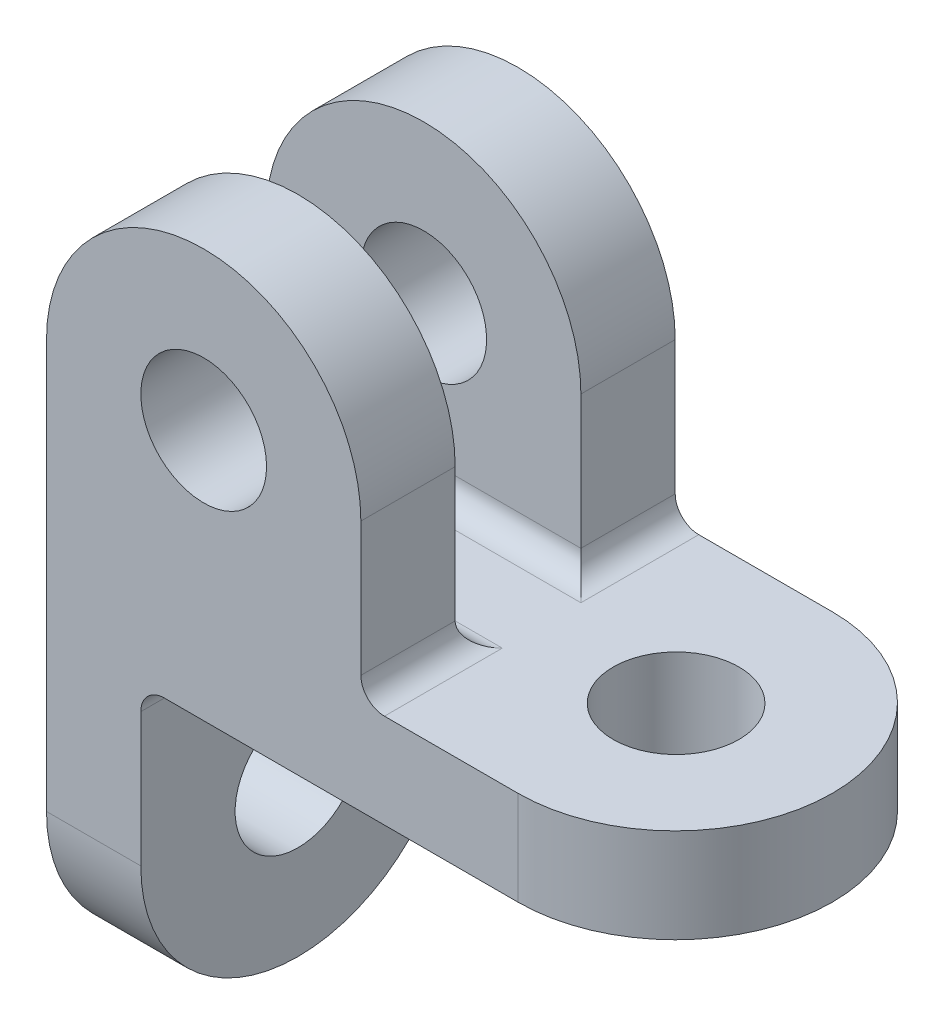
ISO-10303-21;
HEADER;
FILE_DESCRIPTION(('STEP AP214'),'2;1');
FILE_NAME('part.step','',(''),(''),'','','');
FILE_SCHEMA(('AUTOMOTIVE_DESIGN { 1 0 10303 214 1 1 1 1 }'));
ENDSEC;
DATA;
#1=APPLICATION_CONTEXT('core data for automotive mechanical design processes');
#2=APPLICATION_PROTOCOL_DEFINITION('international standard','automotive_design',2000,#1);
#3=PRODUCT_CONTEXT('',#1,'mechanical');
#4=PRODUCT('Part','Part','',(#3));
#5=PRODUCT_RELATED_PRODUCT_CATEGORY('part','',(#4));
#6=PRODUCT_DEFINITION_FORMATION('','',#4);
#7=PRODUCT_DEFINITION_CONTEXT('part definition',#1,'design');
#8=PRODUCT_DEFINITION('design','',#6,#7);
#9=PRODUCT_DEFINITION_SHAPE('','',#8);
#10=(LENGTH_UNIT() NAMED_UNIT(*) SI_UNIT(.MILLI.,.METRE.));
#11=(NAMED_UNIT(*) PLANE_ANGLE_UNIT() SI_UNIT($,.RADIAN.));
#12=(NAMED_UNIT(*) SI_UNIT($,.STERADIAN.) SOLID_ANGLE_UNIT());
#13=UNCERTAINTY_MEASURE_WITH_UNIT(LENGTH_MEASURE(1.E-05),#10,'distance_accuracy_value','');
#14=(GEOMETRIC_REPRESENTATION_CONTEXT(3) GLOBAL_UNCERTAINTY_ASSIGNED_CONTEXT((#13)) GLOBAL_UNIT_ASSIGNED_CONTEXT((#10,
#11,#12)) REPRESENTATION_CONTEXT('',''));
#15=CARTESIAN_POINT('',(0.,0.,0.));
#16=DIRECTION('',(0.,0.,1.));
#17=DIRECTION('',(1.,0.,0.));
#18=AXIS2_PLACEMENT_3D('',#15,#16,#17);
#19=CARTESIAN_POINT('',(30.,0.,0.));
#20=DIRECTION('',(0.,1.,0.));
#21=DIRECTION('',(0.,0.,1.));
#22=AXIS2_PLACEMENT_3D('',#19,#20,#21);
#23=PLANE('',#22);
#24=CARTESIAN_POINT('',(30.1305151637325,0.,0.0175916907778541));
#25=DIRECTION('',(0.,1.,0.));
#26=DIRECTION('',(0.,0.,1.));
#27=AXIS2_PLACEMENT_3D('',#24,#25,#26);
#28=CIRCLE('',#27,8.);
#29=CARTESIAN_POINT('',(30.1305151637325,0.,8.01759169077785));
#30=VERTEX_POINT('',#29);
#31=EDGE_CURVE('E384',#30,#30,#28,.T.);
#32=ORIENTED_EDGE('',*,*,#31,.T.);
#33=EDGE_LOOP('',(#32));
#34=FACE_BOUND('',#33,.T.);
#35=DIRECTION('',(1.,0.,0.));
#36=VECTOR('',#35,1.);
#37=CARTESIAN_POINT('',(-30.,0.,20.));
#38=LINE('',#37,#36);
#39=CARTESIAN_POINT('',(-15.,0.,20.));
#40=VERTEX_POINT('',#39);
#41=CARTESIAN_POINT('',(30.,0.,20.));
#42=VERTEX_POINT('',#41);
#43=EDGE_CURVE('E217',#40,#42,#38,.T.);
#44=ORIENTED_EDGE('',*,*,#43,.F.);
#45=DIRECTION('',(0.,0.,1.));
#46=VECTOR('',#45,1.);
#47=CARTESIAN_POINT('',(-15.,0.,-20.));
#48=LINE('',#47,#46);
#49=CARTESIAN_POINT('',(-15.,0.,-20.));
#50=VERTEX_POINT('',#49);
#51=EDGE_CURVE('E253',#40,#50,#48,.F.);
#52=ORIENTED_EDGE('',*,*,#51,.T.);
#53=DIRECTION('',(1.,0.,0.));
#54=VECTOR('',#53,1.);
#55=CARTESIAN_POINT('',(-30.,0.,-20.));
#56=LINE('',#55,#54);
#57=CARTESIAN_POINT('',(30.,0.,-20.));
#58=VERTEX_POINT('',#57);
#59=EDGE_CURVE('E224',#50,#58,#56,.T.);
#60=ORIENTED_EDGE('',*,*,#59,.T.);
#61=CARTESIAN_POINT('',(30.,0.,0.));
#62=DIRECTION('',(0.,1.,0.));
#63=DIRECTION('',(0.,0.,1.));
#64=AXIS2_PLACEMENT_3D('',#61,#62,#63);
#65=CIRCLE('',#64,20.);
#66=EDGE_CURVE('E233',#42,#58,#65,.T.);
#67=ORIENTED_EDGE('',*,*,#66,.F.);
#68=EDGE_LOOP('',(#44,#52,#60,#67));
#69=FACE_BOUND('',#68,.T.);
#70=ADVANCED_FACE('F35',(#34,#69),#23,.F.);
#71=CARTESIAN_POINT('',(30.,12.,0.));
#72=DIRECTION('',(0.,1.,0.));
#73=DIRECTION('',(0.,0.,1.));
#74=AXIS2_PLACEMENT_3D('',#71,#72,#73);
#75=PLANE('',#74);
#76=CARTESIAN_POINT('',(30.1305151637325,12.,0.0175916907778541));
#77=DIRECTION('',(0.,1.,0.));
#78=DIRECTION('',(0.,0.,1.));
#79=AXIS2_PLACEMENT_3D('',#76,#77,#78);
#80=CIRCLE('',#79,8.);
#81=CARTESIAN_POINT('',(30.1305151637325,12.,8.01759169077785));
#82=VERTEX_POINT('',#81);
#83=EDGE_CURVE('E381',#82,#82,#80,.T.);
#84=ORIENTED_EDGE('',*,*,#83,.F.);
#85=EDGE_LOOP('',(#84));
#86=FACE_BOUND('',#85,.T.);
#87=DIRECTION('',(0.,0.,-1.));
#88=VECTOR('',#87,1.);
#89=CARTESIAN_POINT('',(13.,12.,0.));
#90=LINE('',#89,#88);
#91=CARTESIAN_POINT('',(13.,12.,-20.));
#92=VERTEX_POINT('',#91);
#93=CARTESIAN_POINT('',(13.,12.,-5.));
#94=VERTEX_POINT('',#93);
#95=EDGE_CURVE('E262',#92,#94,#90,.F.);
#96=ORIENTED_EDGE('',*,*,#95,.T.);
#97=DIRECTION('',(1.,0.,0.));
#98=VECTOR('',#97,1.);
#99=CARTESIAN_POINT('',(30.,12.,-5.));
#100=LINE('',#99,#98);
#101=CARTESIAN_POINT('',(-30.,12.,-5.));
#102=VERTEX_POINT('',#101);
#103=EDGE_CURVE('E264',#94,#102,#100,.F.);
#104=ORIENTED_EDGE('',*,*,#103,.T.);
#105=DIRECTION('',(0.,0.,1.));
#106=VECTOR('',#105,1.);
#107=CARTESIAN_POINT('',(-30.,12.,-20.));
#108=LINE('',#107,#106);
#109=CARTESIAN_POINT('',(-30.,12.,5.));
#110=VERTEX_POINT('',#109);
#111=EDGE_CURVE('E220',#102,#110,#108,.T.);
#112=ORIENTED_EDGE('',*,*,#111,.T.);
#113=DIRECTION('',(-1.,0.,0.));
#114=VECTOR('',#113,1.);
#115=CARTESIAN_POINT('',(30.,12.,5.));
#116=LINE('',#115,#114);
#117=CARTESIAN_POINT('',(13.,12.,5.));
#118=VERTEX_POINT('',#117);
#119=EDGE_CURVE('E260',#110,#118,#116,.F.);
#120=ORIENTED_EDGE('',*,*,#119,.T.);
#121=DIRECTION('',(0.,0.,1.));
#122=VECTOR('',#121,1.);
#123=CARTESIAN_POINT('',(13.,12.,20.));
#124=LINE('',#123,#122);
#125=CARTESIAN_POINT('',(13.,12.,20.));
#126=VERTEX_POINT('',#125);
#127=EDGE_CURVE('E258',#118,#126,#124,.T.);
#128=ORIENTED_EDGE('',*,*,#127,.T.);
#129=DIRECTION('',(1.,0.,0.));
#130=VECTOR('',#129,1.);
#131=CARTESIAN_POINT('',(-30.,12.,20.));
#132=LINE('',#131,#130);
#133=CARTESIAN_POINT('',(30.,12.,20.));
#134=VERTEX_POINT('',#133);
#135=EDGE_CURVE('E223',#126,#134,#132,.T.);
#136=ORIENTED_EDGE('',*,*,#135,.T.);
#137=CARTESIAN_POINT('',(30.,12.,0.));
#138=DIRECTION('',(0.,1.,0.));
#139=DIRECTION('',(0.,0.,1.));
#140=AXIS2_PLACEMENT_3D('',#137,#138,#139);
#141=CIRCLE('',#140,20.);
#142=CARTESIAN_POINT('',(30.,12.,-20.));
#143=VERTEX_POINT('',#142);
#144=EDGE_CURVE('E226',#134,#143,#141,.T.);
#145=ORIENTED_EDGE('',*,*,#144,.T.);
#146=DIRECTION('',(1.,0.,0.));
#147=VECTOR('',#146,1.);
#148=CARTESIAN_POINT('',(-30.,12.,-20.));
#149=LINE('',#148,#147);
#150=EDGE_CURVE('E229',#92,#143,#149,.T.);
#151=ORIENTED_EDGE('',*,*,#150,.F.);
#152=EDGE_LOOP('',(#96,#104,#112,#120,#128,#136,#145,#151));
#153=FACE_BOUND('',#152,.T.);
#154=ADVANCED_FACE('F313',(#86,#153),#75,.T.);
#155=CARTESIAN_POINT('',(-30.,12.,-20.));
#156=DIRECTION('',(1.,0.,0.));
#157=DIRECTION('',(0.,0.,-1.));
#158=AXIS2_PLACEMENT_3D('',#155,#156,#157);
#159=PLANE('',#158);
#160=CARTESIAN_POINT('',(-30.,-20.,0.));
#161=DIRECTION('',(1.,0.,0.));
#162=DIRECTION('',(0.,0.,-1.));
#163=AXIS2_PLACEMENT_3D('',#160,#161,#162);
#164=CIRCLE('',#163,8.);
#165=CARTESIAN_POINT('',(-30.,-20.,-7.99999999999999));
#166=VERTEX_POINT('',#165);
#167=EDGE_CURVE('E287',#166,#166,#164,.T.);
#168=ORIENTED_EDGE('',*,*,#167,.T.);
#169=EDGE_LOOP('',(#168));
#170=FACE_BOUND('',#169,.T.);
#171=DIRECTION('',(0.,-1.,0.));
#172=VECTOR('',#171,1.);
#173=CARTESIAN_POINT('',(-30.,12.,-20.));
#174=LINE('',#173,#172);
#175=CARTESIAN_POINT('',(-30.,31.9999999999999,-20.));
#176=VERTEX_POINT('',#175);
#177=CARTESIAN_POINT('',(-30.,-20.,-20.));
#178=VERTEX_POINT('',#177);
#179=EDGE_CURVE('E231',#176,#178,#174,.T.);
#180=ORIENTED_EDGE('',*,*,#179,.T.);
#181=CARTESIAN_POINT('',(-30.,-20.,0.));
#182=DIRECTION('',(-1.,0.,0.));
#183=DIRECTION('',(0.,0.,1.));
#184=AXIS2_PLACEMENT_3D('',#181,#182,#183);
#185=CIRCLE('',#184,20.);
#186=CARTESIAN_POINT('',(-30.,-20.,20.));
#187=VERTEX_POINT('',#186);
#188=EDGE_CURVE('E163',#178,#187,#185,.T.);
#189=ORIENTED_EDGE('',*,*,#188,.T.);
#190=DIRECTION('',(0.,-1.,0.));
#191=VECTOR('',#190,1.);
#192=CARTESIAN_POINT('',(-30.,12.,20.));
#193=LINE('',#192,#191);
#194=CARTESIAN_POINT('',(-30.,32.,20.));
#195=VERTEX_POINT('',#194);
#196=EDGE_CURVE('E244',#195,#187,#193,.T.);
#197=ORIENTED_EDGE('',*,*,#196,.F.);
#198=DIRECTION('',(0.,0.,1.));
#199=VECTOR('',#198,1.);
#200=CARTESIAN_POINT('',(-30.,32.,8.));
#201=LINE('',#200,#199);
#202=CARTESIAN_POINT('',(-30.,32.,8.));
#203=VERTEX_POINT('',#202);
#204=EDGE_CURVE('E210',#203,#195,#201,.T.);
#205=ORIENTED_EDGE('',*,*,#204,.F.);
#206=DIRECTION('',(0.,1.,0.));
#207=VECTOR('',#206,1.);
#208=CARTESIAN_POINT('',(-30.,0.,8.));
#209=LINE('',#208,#207);
#210=CARTESIAN_POINT('',(-30.,15.,8.));
#211=VERTEX_POINT('',#210);
#212=EDGE_CURVE('E205',#211,#203,#209,.T.);
#213=ORIENTED_EDGE('',*,*,#212,.F.);
#214=CARTESIAN_POINT('',(-30.,15.,5.));
#215=DIRECTION('',(1.,0.,0.));
#216=DIRECTION('',(0.,0.,-1.));
#217=AXIS2_PLACEMENT_3D('',#214,#215,#216);
#218=CIRCLE('',#217,3.);
#219=EDGE_CURVE('E275',#211,#110,#218,.T.);
#220=ORIENTED_EDGE('',*,*,#219,.T.);
#221=ORIENTED_EDGE('',*,*,#111,.F.);
#222=CARTESIAN_POINT('',(-30.,15.,-5.));
#223=DIRECTION('',(1.,0.,0.));
#224=DIRECTION('',(0.,0.,-1.));
#225=AXIS2_PLACEMENT_3D('',#222,#223,#224);
#226=CIRCLE('',#225,3.);
#227=CARTESIAN_POINT('',(-30.,15.,-8.));
#228=VERTEX_POINT('',#227);
#229=EDGE_CURVE('E277',#102,#228,#226,.T.);
#230=ORIENTED_EDGE('',*,*,#229,.T.);
#231=DIRECTION('',(0.,1.,0.));
#232=VECTOR('',#231,1.);
#233=CARTESIAN_POINT('',(-30.,0.,-8.));
#234=LINE('',#233,#232);
#235=CARTESIAN_POINT('',(-30.,31.9999999999999,-8.));
#236=VERTEX_POINT('',#235);
#237=EDGE_CURVE('E184',#228,#236,#234,.T.);
#238=ORIENTED_EDGE('',*,*,#237,.T.);
#239=DIRECTION('',(0.,0.,-1.));
#240=VECTOR('',#239,1.);
#241=CARTESIAN_POINT('',(-30.,31.9999999999999,-8.));
#242=LINE('',#241,#240);
#243=EDGE_CURVE('E192',#236,#176,#242,.T.);
#244=ORIENTED_EDGE('',*,*,#243,.T.);
#245=EDGE_LOOP('',(#180,#189,#197,#205,#213,#220,#221,#230,#238,#244));
#246=FACE_BOUND('',#245,.T.);
#247=ADVANCED_FACE('F309',(#170,#246),#159,.F.);
#248=CARTESIAN_POINT('',(-30.,12.,20.));
#249=DIRECTION('',(0.,0.,-1.));
#250=DIRECTION('',(-1.,0.,0.));
#251=AXIS2_PLACEMENT_3D('',#248,#249,#250);
#252=PLANE('',#251);
#253=CARTESIAN_POINT('',(-10.,32.,20.));
#254=DIRECTION('',(0.,0.,1.));
#255=DIRECTION('',(1.,0.,0.));
#256=AXIS2_PLACEMENT_3D('',#253,#254,#255);
#257=CIRCLE('',#256,8.);
#258=CARTESIAN_POINT('',(-2.,32.,20.));
#259=VERTEX_POINT('',#258);
#260=EDGE_CURVE('E251',#259,#259,#257,.T.);
#261=ORIENTED_EDGE('',*,*,#260,.F.);
#262=EDGE_LOOP('',(#261));
#263=FACE_BOUND('',#262,.T.);
#264=ORIENTED_EDGE('',*,*,#196,.T.);
#265=DIRECTION('',(-1.,0.,0.));
#266=VECTOR('',#265,1.);
#267=CARTESIAN_POINT('',(-18.,-20.,20.));
#268=LINE('',#267,#266);
#269=CARTESIAN_POINT('',(-18.,-20.,20.));
#270=VERTEX_POINT('',#269);
#271=EDGE_CURVE('E170',#270,#187,#268,.T.);
#272=ORIENTED_EDGE('',*,*,#271,.F.);
#273=DIRECTION('',(0.,-1.,0.));
#274=VECTOR('',#273,1.);
#275=CARTESIAN_POINT('',(-18.,0.,20.));
#276=LINE('',#275,#274);
#277=CARTESIAN_POINT('',(-18.,-3.,20.));
#278=VERTEX_POINT('',#277);
#279=EDGE_CURVE('E171',#278,#270,#276,.T.);
#280=ORIENTED_EDGE('',*,*,#279,.F.);
#281=CARTESIAN_POINT('',(-15.,-3.,20.));
#282=DIRECTION('',(0.,0.,-1.));
#283=DIRECTION('',(-1.,0.,0.));
#284=AXIS2_PLACEMENT_3D('',#281,#282,#283);
#285=CIRCLE('',#284,3.);
#286=EDGE_CURVE('E272',#278,#40,#285,.T.);
#287=ORIENTED_EDGE('',*,*,#286,.T.);
#288=ORIENTED_EDGE('',*,*,#43,.T.);
#289=DIRECTION('',(0.,-1.,0.));
#290=VECTOR('',#289,1.);
#291=CARTESIAN_POINT('',(30.,12.,20.));
#292=LINE('',#291,#290);
#293=EDGE_CURVE('E241',#134,#42,#292,.T.);
#294=ORIENTED_EDGE('',*,*,#293,.F.);
#295=ORIENTED_EDGE('',*,*,#135,.F.);
#296=CARTESIAN_POINT('',(13.,15.,20.));
#297=DIRECTION('',(0.,0.,-1.));
#298=DIRECTION('',(-1.,0.,0.));
#299=AXIS2_PLACEMENT_3D('',#296,#297,#298);
#300=CIRCLE('',#299,3.);
#301=CARTESIAN_POINT('',(10.,15.,20.));
#302=VERTEX_POINT('',#301);
#303=EDGE_CURVE('E11',#126,#302,#300,.T.);
#304=ORIENTED_EDGE('',*,*,#303,.T.);
#305=DIRECTION('',(0.,1.,0.));
#306=VECTOR('',#305,1.);
#307=CARTESIAN_POINT('',(10.,0.,20.));
#308=LINE('',#307,#306);
#309=CARTESIAN_POINT('',(10.,32.,20.));
#310=VERTEX_POINT('',#309);
#311=EDGE_CURVE('E206',#302,#310,#308,.T.);
#312=ORIENTED_EDGE('',*,*,#311,.T.);
#313=CARTESIAN_POINT('',(-10.,32.,20.));
#314=DIRECTION('',(0.,0.,1.));
#315=DIRECTION('',(1.,0.,0.));
#316=AXIS2_PLACEMENT_3D('',#313,#314,#315);
#317=CIRCLE('',#316,20.);
#318=EDGE_CURVE('E199',#310,#195,#317,.T.);
#319=ORIENTED_EDGE('',*,*,#318,.T.);
#320=EDGE_LOOP('',(#264,#272,#280,#287,#288,#294,#295,#304,#312,#319));
#321=FACE_BOUND('',#320,.T.);
#322=ADVANCED_FACE('F331',(#263,#321),#252,.F.);
#323=CARTESIAN_POINT('',(30.,12.,0.));
#324=DIRECTION('',(0.,-1.,0.));
#325=DIRECTION('',(0.,0.,-1.));
#326=AXIS2_PLACEMENT_3D('',#323,#324,#325);
#327=CYLINDRICAL_SURFACE('',#326,20.);
#328=ORIENTED_EDGE('',*,*,#66,.T.);
#329=DIRECTION('',(0.,-1.,0.));
#330=VECTOR('',#329,1.);
#331=CARTESIAN_POINT('',(30.,12.,-20.));
#332=LINE('',#331,#330);
#333=EDGE_CURVE('E238',#143,#58,#332,.T.);
#334=ORIENTED_EDGE('',*,*,#333,.F.);
#335=ORIENTED_EDGE('',*,*,#144,.F.);
#336=ORIENTED_EDGE('',*,*,#293,.T.);
#337=EDGE_LOOP('',(#328,#334,#335,#336));
#338=FACE_BOUND('',#337,.T.);
#339=ADVANCED_FACE('F337',(#338),#327,.T.);
#340=CARTESIAN_POINT('',(-30.,12.,-20.));
#341=DIRECTION('',(0.,0.,-1.));
#342=DIRECTION('',(-1.,0.,0.));
#343=AXIS2_PLACEMENT_3D('',#340,#341,#342);
#344=PLANE('',#343);
#345=CARTESIAN_POINT('',(-10.,32.,-20.));
#346=DIRECTION('',(0.,0.,-1.));
#347=DIRECTION('',(-1.,0.,0.));
#348=AXIS2_PLACEMENT_3D('',#345,#346,#347);
#349=CIRCLE('',#348,8.);
#350=CARTESIAN_POINT('',(-18.,32.,-20.));
#351=VERTEX_POINT('',#350);
#352=EDGE_CURVE('E181',#351,#351,#349,.T.);
#353=ORIENTED_EDGE('',*,*,#352,.F.);
#354=EDGE_LOOP('',(#353));
#355=FACE_BOUND('',#354,.T.);
#356=ORIENTED_EDGE('',*,*,#59,.F.);
#357=CARTESIAN_POINT('',(-15.,-3.,-20.));
#358=DIRECTION('',(0.,0.,-1.));
#359=DIRECTION('',(-1.,0.,0.));
#360=AXIS2_PLACEMENT_3D('',#357,#358,#359);
#361=CIRCLE('',#360,3.);
#362=CARTESIAN_POINT('',(-18.,-3.,-20.));
#363=VERTEX_POINT('',#362);
#364=EDGE_CURVE('E157',#50,#363,#361,.F.);
#365=ORIENTED_EDGE('',*,*,#364,.T.);
#366=DIRECTION('',(0.,-1.,0.));
#367=VECTOR('',#366,1.);
#368=CARTESIAN_POINT('',(-18.,0.,-20.));
#369=LINE('',#368,#367);
#370=CARTESIAN_POINT('',(-18.,-20.,-20.));
#371=VERTEX_POINT('',#370);
#372=EDGE_CURVE('E150',#363,#371,#369,.T.);
#373=ORIENTED_EDGE('',*,*,#372,.T.);
#374=DIRECTION('',(-1.,0.,0.));
#375=VECTOR('',#374,1.);
#376=CARTESIAN_POINT('',(-18.,-20.,-20.));
#377=LINE('',#376,#375);
#378=EDGE_CURVE('E154',#371,#178,#377,.T.);
#379=ORIENTED_EDGE('',*,*,#378,.T.);
#380=ORIENTED_EDGE('',*,*,#179,.F.);
#381=CARTESIAN_POINT('',(-10.,32.,-20.));
#382=DIRECTION('',(0.,0.,-1.));
#383=DIRECTION('',(-1.,0.,0.));
#384=AXIS2_PLACEMENT_3D('',#381,#382,#383);
#385=CIRCLE('',#384,20.);
#386=CARTESIAN_POINT('',(10.,31.9999999999999,-20.));
#387=VERTEX_POINT('',#386);
#388=EDGE_CURVE('E182',#176,#387,#385,.T.);
#389=ORIENTED_EDGE('',*,*,#388,.T.);
#390=DIRECTION('',(0.,1.,0.));
#391=VECTOR('',#390,1.);
#392=CARTESIAN_POINT('',(10.,0.,-20.));
#393=LINE('',#392,#391);
#394=CARTESIAN_POINT('',(10.,15.,-20.));
#395=VERTEX_POINT('',#394);
#396=EDGE_CURVE('E187',#395,#387,#393,.T.);
#397=ORIENTED_EDGE('',*,*,#396,.F.);
#398=CARTESIAN_POINT('',(13.,15.,-20.));
#399=DIRECTION('',(0.,0.,-1.));
#400=DIRECTION('',(-1.,0.,0.));
#401=AXIS2_PLACEMENT_3D('',#398,#399,#400);
#402=CIRCLE('',#401,3.);
#403=EDGE_CURVE('E44',#395,#92,#402,.F.);
#404=ORIENTED_EDGE('',*,*,#403,.T.);
#405=ORIENTED_EDGE('',*,*,#150,.T.);
#406=ORIENTED_EDGE('',*,*,#333,.T.);
#407=EDGE_LOOP('',(#356,#365,#373,#379,#380,#389,#397,#404,#405,#406));
#408=FACE_BOUND('',#407,.T.);
#409=ADVANCED_FACE('F153',(#355,#408),#344,.T.);
#410=CARTESIAN_POINT('',(-10.,32.,8.));
#411=DIRECTION('',(0.,0.,1.));
#412=DIRECTION('',(1.,0.,0.));
#413=AXIS2_PLACEMENT_3D('',#410,#411,#412);
#414=CYLINDRICAL_SURFACE('',#413,20.);
#415=ORIENTED_EDGE('',*,*,#318,.F.);
#416=DIRECTION('',(0.,0.,1.));
#417=VECTOR('',#416,1.);
#418=CARTESIAN_POINT('',(10.,32.,8.));
#419=LINE('',#418,#417);
#420=CARTESIAN_POINT('',(10.,32.,8.));
#421=VERTEX_POINT('',#420);
#422=EDGE_CURVE('E214',#421,#310,#419,.T.);
#423=ORIENTED_EDGE('',*,*,#422,.F.);
#424=CARTESIAN_POINT('',(-10.,32.,8.));
#425=DIRECTION('',(0.,0.,1.));
#426=DIRECTION('',(1.,0.,0.));
#427=AXIS2_PLACEMENT_3D('',#424,#425,#426);
#428=CIRCLE('',#427,20.);
#429=EDGE_CURVE('E202',#421,#203,#428,.T.);
#430=ORIENTED_EDGE('',*,*,#429,.T.);
#431=ORIENTED_EDGE('',*,*,#204,.T.);
#432=EDGE_LOOP('',(#415,#423,#430,#431));
#433=FACE_BOUND('',#432,.T.);
#434=ADVANCED_FACE('F324',(#433),#414,.T.);
#435=CARTESIAN_POINT('',(10.,0.,8.));
#436=DIRECTION('',(1.,0.,0.));
#437=DIRECTION('',(0.,0.,-1.));
#438=AXIS2_PLACEMENT_3D('',#435,#436,#437);
#439=PLANE('',#438);
#440=ORIENTED_EDGE('',*,*,#311,.F.);
#441=DIRECTION('',(0.,0.,1.));
#442=VECTOR('',#441,1.);
#443=CARTESIAN_POINT('',(10.,15.,8.));
#444=LINE('',#443,#442);
#445=CARTESIAN_POINT('',(10.,15.,8.));
#446=VERTEX_POINT('',#445);
#447=EDGE_CURVE('E270',#302,#446,#444,.F.);
#448=ORIENTED_EDGE('',*,*,#447,.T.);
#449=DIRECTION('',(0.,1.,0.));
#450=VECTOR('',#449,1.);
#451=CARTESIAN_POINT('',(10.,0.,8.));
#452=LINE('',#451,#450);
#453=EDGE_CURVE('E208',#446,#421,#452,.T.);
#454=ORIENTED_EDGE('',*,*,#453,.T.);
#455=ORIENTED_EDGE('',*,*,#422,.T.);
#456=EDGE_LOOP('',(#440,#448,#454,#455));
#457=FACE_BOUND('',#456,.T.);
#458=ADVANCED_FACE('F326',(#457),#439,.T.);
#459=CARTESIAN_POINT('',(0.,0.,8.));
#460=DIRECTION('',(0.,0.,1.));
#461=DIRECTION('',(1.,0.,0.));
#462=AXIS2_PLACEMENT_3D('',#459,#460,#461);
#463=PLANE('',#462);
#464=CARTESIAN_POINT('',(-10.,32.,7.99999999999999));
#465=DIRECTION('',(0.,0.,1.));
#466=DIRECTION('',(1.,0.,0.));
#467=AXIS2_PLACEMENT_3D('',#464,#465,#466);
#468=CIRCLE('',#467,8.);
#469=CARTESIAN_POINT('',(-2.,32.,7.99999999999999));
#470=VERTEX_POINT('',#469);
#471=EDGE_CURVE('E250',#470,#470,#468,.T.);
#472=ORIENTED_EDGE('',*,*,#471,.T.);
#473=EDGE_LOOP('',(#472));
#474=FACE_BOUND('',#473,.T.);
#475=ORIENTED_EDGE('',*,*,#453,.F.);
#476=DIRECTION('',(-1.,0.,0.));
#477=VECTOR('',#476,1.);
#478=CARTESIAN_POINT('',(0.,15.,8.));
#479=LINE('',#478,#477);
#480=EDGE_CURVE('E255',#446,#211,#479,.T.);
#481=ORIENTED_EDGE('',*,*,#480,.T.);
#482=ORIENTED_EDGE('',*,*,#212,.T.);
#483=ORIENTED_EDGE('',*,*,#429,.F.);
#484=EDGE_LOOP('',(#475,#481,#482,#483));
#485=FACE_BOUND('',#484,.T.);
#486=ADVANCED_FACE('F318',(#474,#485),#463,.F.);
#487=CARTESIAN_POINT('',(10.,0.,-8.));
#488=DIRECTION('',(-1.,0.,0.));
#489=DIRECTION('',(0.,0.,1.));
#490=AXIS2_PLACEMENT_3D('',#487,#488,#489);
#491=PLANE('',#490);
#492=DIRECTION('',(0.,1.,0.));
#493=VECTOR('',#492,1.);
#494=CARTESIAN_POINT('',(10.,0.,-8.));
#495=LINE('',#494,#493);
#496=CARTESIAN_POINT('',(10.,15.,-8.));
#497=VERTEX_POINT('',#496);
#498=CARTESIAN_POINT('',(10.,31.9999999999999,-8.));
#499=VERTEX_POINT('',#498);
#500=EDGE_CURVE('E190',#497,#499,#495,.T.);
#501=ORIENTED_EDGE('',*,*,#500,.F.);
#502=DIRECTION('',(0.,0.,-1.));
#503=VECTOR('',#502,1.);
#504=CARTESIAN_POINT('',(10.,15.,-8.));
#505=LINE('',#504,#503);
#506=EDGE_CURVE('E58',#497,#395,#505,.T.);
#507=ORIENTED_EDGE('',*,*,#506,.T.);
#508=ORIENTED_EDGE('',*,*,#396,.T.);
#509=DIRECTION('',(0.,0.,-1.));
#510=VECTOR('',#509,1.);
#511=CARTESIAN_POINT('',(10.,31.9999999999999,-8.));
#512=LINE('',#511,#510);
#513=EDGE_CURVE('E196',#499,#387,#512,.T.);
#514=ORIENTED_EDGE('',*,*,#513,.F.);
#515=EDGE_LOOP('',(#501,#507,#508,#514));
#516=FACE_BOUND('',#515,.T.);
#517=ADVANCED_FACE('F303',(#516),#491,.F.);
#518=CARTESIAN_POINT('',(-10.,32.,-8.));
#519=DIRECTION('',(0.,0.,-1.));
#520=DIRECTION('',(-1.,0.,0.));
#521=AXIS2_PLACEMENT_3D('',#518,#519,#520);
#522=CYLINDRICAL_SURFACE('',#521,20.);
#523=ORIENTED_EDGE('',*,*,#388,.F.);
#524=ORIENTED_EDGE('',*,*,#243,.F.);
#525=CARTESIAN_POINT('',(-10.,32.,-8.));
#526=DIRECTION('',(0.,0.,-1.));
#527=DIRECTION('',(-1.,0.,0.));
#528=AXIS2_PLACEMENT_3D('',#525,#526,#527);
#529=CIRCLE('',#528,20.);
#530=EDGE_CURVE('E186',#236,#499,#529,.T.);
#531=ORIENTED_EDGE('',*,*,#530,.T.);
#532=ORIENTED_EDGE('',*,*,#513,.T.);
#533=EDGE_LOOP('',(#523,#524,#531,#532));
#534=FACE_BOUND('',#533,.T.);
#535=ADVANCED_FACE('F307',(#534),#522,.T.);
#536=CARTESIAN_POINT('',(0.,0.,-8.));
#537=DIRECTION('',(0.,0.,-1.));
#538=DIRECTION('',(-1.,0.,0.));
#539=AXIS2_PLACEMENT_3D('',#536,#537,#538);
#540=PLANE('',#539);
#541=CARTESIAN_POINT('',(-10.,32.,-8.00000000000001));
#542=DIRECTION('',(0.,0.,-1.));
#543=DIRECTION('',(-1.,0.,0.));
#544=AXIS2_PLACEMENT_3D('',#541,#542,#543);
#545=CIRCLE('',#544,8.);
#546=CARTESIAN_POINT('',(-18.,32.,-8.00000000000001));
#547=VERTEX_POINT('',#546);
#548=EDGE_CURVE('E247',#547,#547,#545,.T.);
#549=ORIENTED_EDGE('',*,*,#548,.T.);
#550=EDGE_LOOP('',(#549));
#551=FACE_BOUND('',#550,.T.);
#552=ORIENTED_EDGE('',*,*,#237,.F.);
#553=DIRECTION('',(1.,0.,0.));
#554=VECTOR('',#553,1.);
#555=CARTESIAN_POINT('',(0.,15.,-8.));
#556=LINE('',#555,#554);
#557=EDGE_CURVE('E266',#228,#497,#556,.T.);
#558=ORIENTED_EDGE('',*,*,#557,.T.);
#559=ORIENTED_EDGE('',*,*,#500,.T.);
#560=ORIENTED_EDGE('',*,*,#530,.F.);
#561=EDGE_LOOP('',(#552,#558,#559,#560));
#562=FACE_BOUND('',#561,.T.);
#563=ADVANCED_FACE('F300',(#551,#562),#540,.F.);
#564=CARTESIAN_POINT('',(-18.,-20.,0.));
#565=DIRECTION('',(-1.,0.,0.));
#566=DIRECTION('',(0.,0.,1.));
#567=AXIS2_PLACEMENT_3D('',#564,#565,#566);
#568=CYLINDRICAL_SURFACE('',#567,20.);
#569=ORIENTED_EDGE('',*,*,#188,.F.);
#570=ORIENTED_EDGE('',*,*,#378,.F.);
#571=CARTESIAN_POINT('',(-18.,-20.,0.));
#572=DIRECTION('',(-1.,0.,0.));
#573=DIRECTION('',(0.,0.,1.));
#574=AXIS2_PLACEMENT_3D('',#571,#572,#573);
#575=CIRCLE('',#574,20.);
#576=EDGE_CURVE('E162',#371,#270,#575,.T.);
#577=ORIENTED_EDGE('',*,*,#576,.T.);
#578=ORIENTED_EDGE('',*,*,#271,.T.);
#579=EDGE_LOOP('',(#569,#570,#577,#578));
#580=FACE_BOUND('',#579,.T.);
#581=ADVANCED_FACE('F167',(#580),#568,.T.);
#582=CARTESIAN_POINT('',(-18.,0.,0.));
#583=DIRECTION('',(-1.,0.,0.));
#584=DIRECTION('',(0.,0.,1.));
#585=AXIS2_PLACEMENT_3D('',#582,#583,#584);
#586=PLANE('',#585);
#587=CARTESIAN_POINT('',(-18.,-20.,0.));
#588=DIRECTION('',(1.,0.,0.));
#589=DIRECTION('',(0.,0.,-1.));
#590=AXIS2_PLACEMENT_3D('',#587,#588,#589);
#591=CIRCLE('',#590,8.);
#592=CARTESIAN_POINT('',(-18.,-20.,-7.99999999999999));
#593=VERTEX_POINT('',#592);
#594=EDGE_CURVE('E281',#593,#593,#591,.T.);
#595=ORIENTED_EDGE('',*,*,#594,.F.);
#596=EDGE_LOOP('',(#595));
#597=FACE_BOUND('',#596,.T.);
#598=ORIENTED_EDGE('',*,*,#372,.F.);
#599=DIRECTION('',(0.,0.,1.));
#600=VECTOR('',#599,1.);
#601=CARTESIAN_POINT('',(-18.,-3.,20.));
#602=LINE('',#601,#600);
#603=EDGE_CURVE('E246',#363,#278,#602,.T.);
#604=ORIENTED_EDGE('',*,*,#603,.T.);
#605=ORIENTED_EDGE('',*,*,#279,.T.);
#606=ORIENTED_EDGE('',*,*,#576,.F.);
#607=EDGE_LOOP('',(#598,#604,#605,#606));
#608=FACE_BOUND('',#607,.T.);
#609=ADVANCED_FACE('F173',(#597,#608),#586,.F.);
#610=CARTESIAN_POINT('',(-10.,32.,-108.));
#611=DIRECTION('',(0.,0.,1.));
#612=DIRECTION('',(1.,0.,0.));
#613=AXIS2_PLACEMENT_3D('',#610,#611,#612);
#614=CYLINDRICAL_SURFACE('',#613,8.);
#615=ORIENTED_EDGE('',*,*,#352,.T.);
#616=EDGE_LOOP('',(#615));
#617=FACE_BOUND('',#616,.T.);
#618=ORIENTED_EDGE('',*,*,#548,.F.);
#619=EDGE_LOOP('',(#618));
#620=FACE_BOUND('',#619,.T.);
#621=ADVANCED_FACE('F394',(#617,#620),#614,.F.);
#622=ORIENTED_EDGE('',*,*,#260,.T.);
#623=EDGE_LOOP('',(#622));
#624=FACE_BOUND('',#623,.T.);
#625=ORIENTED_EDGE('',*,*,#471,.F.);
#626=EDGE_LOOP('',(#625));
#627=FACE_BOUND('',#626,.T.);
#628=ADVANCED_FACE('F397',(#624,#627),#614,.F.);
#629=CARTESIAN_POINT('',(30.1305151637325,-116.,0.0175916907778541));
#630=DIRECTION('',(0.,1.,0.));
#631=DIRECTION('',(0.,0.,1.));
#632=AXIS2_PLACEMENT_3D('',#629,#630,#631);
#633=CYLINDRICAL_SURFACE('',#632,8.);
#634=ORIENTED_EDGE('',*,*,#83,.T.);
#635=EDGE_LOOP('',(#634));
#636=FACE_BOUND('',#635,.T.);
#637=ORIENTED_EDGE('',*,*,#31,.F.);
#638=EDGE_LOOP('',(#637));
#639=FACE_BOUND('',#638,.T.);
#640=ADVANCED_FACE('F351',(#636,#639),#633,.F.);
#641=CARTESIAN_POINT('',(-146.,-20.,0.));
#642=DIRECTION('',(1.,0.,0.));
#643=DIRECTION('',(0.,0.,-1.));
#644=AXIS2_PLACEMENT_3D('',#641,#642,#643);
#645=CYLINDRICAL_SURFACE('',#644,8.);
#646=ORIENTED_EDGE('',*,*,#594,.T.);
#647=EDGE_LOOP('',(#646));
#648=FACE_BOUND('',#647,.T.);
#649=ORIENTED_EDGE('',*,*,#167,.F.);
#650=EDGE_LOOP('',(#649));
#651=FACE_BOUND('',#650,.T.);
#652=ADVANCED_FACE('F344',(#648,#651),#645,.F.);
#653=CARTESIAN_POINT('',(-15.,-3.,0.));
#654=DIRECTION('',(0.,0.,-1.));
#655=DIRECTION('',(-1.,0.,0.));
#656=AXIS2_PLACEMENT_3D('',#653,#654,#655);
#657=CYLINDRICAL_SURFACE('',#656,3.);
#658=ORIENTED_EDGE('',*,*,#364,.F.);
#659=ORIENTED_EDGE('',*,*,#51,.F.);
#660=ORIENTED_EDGE('',*,*,#286,.F.);
#661=ORIENTED_EDGE('',*,*,#603,.F.);
#662=EDGE_LOOP('',(#658,#659,#660,#661));
#663=FACE_BOUND('',#662,.T.);
#664=ADVANCED_FACE('F342',(#663),#657,.F.);
#665=CARTESIAN_POINT('',(13.,15.,0.));
#666=DIRECTION('',(0.,0.,-1.));
#667=DIRECTION('',(-1.,0.,0.));
#668=AXIS2_PLACEMENT_3D('',#665,#666,#667);
#669=CYLINDRICAL_SURFACE('',#668,3.);
#670=ORIENTED_EDGE('',*,*,#303,.F.);
#671=ORIENTED_EDGE('',*,*,#127,.F.);
#672=CARTESIAN_POINT('',(13.,15.,5.));
#673=DIRECTION('',(-0.707106781186547,0.,-0.707106781186547));
#674=DIRECTION('',(0.707106781186547,0.,-0.707106781186547));
#675=AXIS2_PLACEMENT_3D('',#672,#673,#674);
#676=ELLIPSE('',#675,4.24264068711928,3.);
#677=EDGE_CURVE('E279',#446,#118,#676,.F.);
#678=ORIENTED_EDGE('',*,*,#677,.F.);
#679=ORIENTED_EDGE('',*,*,#447,.F.);
#680=EDGE_LOOP('',(#670,#671,#678,#679));
#681=FACE_BOUND('',#680,.T.);
#682=ADVANCED_FACE('F329',(#681),#669,.F.);
#683=CARTESIAN_POINT('',(0.,15.,5.));
#684=DIRECTION('',(-1.,0.,0.));
#685=DIRECTION('',(0.,0.,1.));
#686=AXIS2_PLACEMENT_3D('',#683,#684,#685);
#687=CYLINDRICAL_SURFACE('',#686,3.);
#688=ORIENTED_EDGE('',*,*,#677,.T.);
#689=ORIENTED_EDGE('',*,*,#119,.F.);
#690=ORIENTED_EDGE('',*,*,#219,.F.);
#691=ORIENTED_EDGE('',*,*,#480,.F.);
#692=EDGE_LOOP('',(#688,#689,#690,#691));
#693=FACE_BOUND('',#692,.T.);
#694=ADVANCED_FACE('F315',(#693),#687,.F.);
#695=CARTESIAN_POINT('',(13.,15.,-8.));
#696=DIRECTION('',(0.,0.,-1.));
#697=DIRECTION('',(-1.,0.,0.));
#698=AXIS2_PLACEMENT_3D('',#695,#696,#697);
#699=CYLINDRICAL_SURFACE('',#698,3.);
#700=ORIENTED_EDGE('',*,*,#403,.F.);
#701=ORIENTED_EDGE('',*,*,#506,.F.);
#702=CARTESIAN_POINT('',(13.,15.,-5.));
#703=DIRECTION('',(0.707106781186547,0.,-0.707106781186547));
#704=DIRECTION('',(-0.707106781186547,0.,-0.707106781186547));
#705=AXIS2_PLACEMENT_3D('',#702,#703,#704);
#706=ELLIPSE('',#705,4.24264068711928,3.);
#707=EDGE_CURVE('E39',#94,#497,#706,.T.);
#708=ORIENTED_EDGE('',*,*,#707,.F.);
#709=ORIENTED_EDGE('',*,*,#95,.F.);
#710=EDGE_LOOP('',(#700,#701,#708,#709));
#711=FACE_BOUND('',#710,.T.);
#712=ADVANCED_FACE('F37',(#711),#699,.F.);
#713=CARTESIAN_POINT('',(0.,15.,-5.));
#714=DIRECTION('',(1.,0.,0.));
#715=DIRECTION('',(0.,0.,-1.));
#716=AXIS2_PLACEMENT_3D('',#713,#714,#715);
#717=CYLINDRICAL_SURFACE('',#716,3.);
#718=ORIENTED_EDGE('',*,*,#229,.F.);
#719=ORIENTED_EDGE('',*,*,#103,.F.);
#720=ORIENTED_EDGE('',*,*,#707,.T.);
#721=ORIENTED_EDGE('',*,*,#557,.F.);
#722=EDGE_LOOP('',(#718,#719,#720,#721));
#723=FACE_BOUND('',#722,.T.);
#724=ADVANCED_FACE('F294',(#723),#717,.F.);
#725=CLOSED_SHELL('',(#70,#154,#247,#322,#339,#409,#434,#458,#486,#517,#535,#563,#581,#609,#621,
#628,#640,#652,#664,#682,#694,#712,#724));
#726=MANIFOLD_SOLID_BREP('B2',#725);
#727=ADVANCED_BREP_SHAPE_REPRESENTATION('',(#18,#726),#14);
#728=SHAPE_DEFINITION_REPRESENTATION(#9,#727);
ENDSEC;
END-ISO-10303-21;
